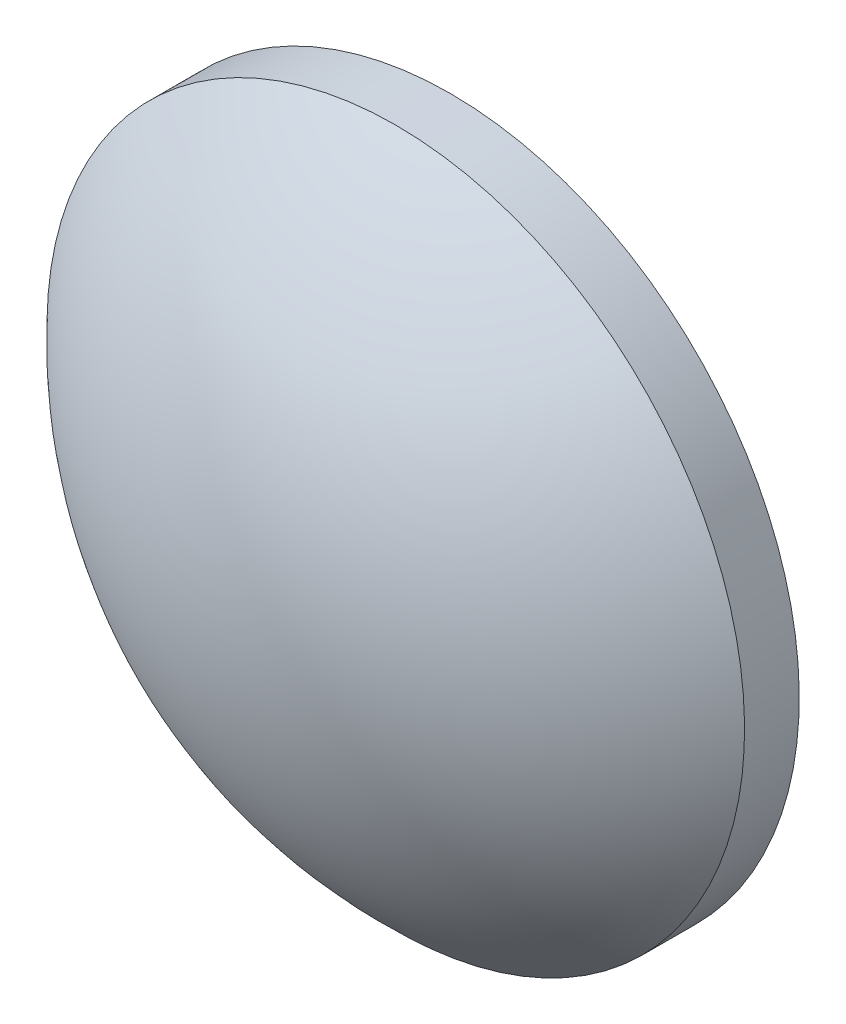
ISO-10303-21;
HEADER;
FILE_DESCRIPTION(('STEP AP214'),'2;1');
FILE_NAME('part.step','',(''),(''),'','','');
FILE_SCHEMA(('AUTOMOTIVE_DESIGN { 1 0 10303 214 1 1 1 1 }'));
ENDSEC;
DATA;
#1=APPLICATION_CONTEXT('core data for automotive mechanical design processes');
#2=APPLICATION_PROTOCOL_DEFINITION('international standard','automotive_design',2000,#1);
#3=PRODUCT_CONTEXT('',#1,'mechanical');
#4=PRODUCT('Part','Part','',(#3));
#5=PRODUCT_RELATED_PRODUCT_CATEGORY('part','',(#4));
#6=PRODUCT_DEFINITION_FORMATION('','',#4);
#7=PRODUCT_DEFINITION_CONTEXT('part definition',#1,'design');
#8=PRODUCT_DEFINITION('design','',#6,#7);
#9=PRODUCT_DEFINITION_SHAPE('','',#8);
#10=(LENGTH_UNIT() NAMED_UNIT(*) SI_UNIT(.MILLI.,.METRE.));
#11=(NAMED_UNIT(*) PLANE_ANGLE_UNIT() SI_UNIT($,.RADIAN.));
#12=(NAMED_UNIT(*) SI_UNIT($,.STERADIAN.) SOLID_ANGLE_UNIT());
#13=UNCERTAINTY_MEASURE_WITH_UNIT(LENGTH_MEASURE(1.E-05),#10,'distance_accuracy_value','');
#14=(GEOMETRIC_REPRESENTATION_CONTEXT(3) GLOBAL_UNCERTAINTY_ASSIGNED_CONTEXT((#13)) GLOBAL_UNIT_ASSIGNED_CONTEXT((#10,
#11,#12)) REPRESENTATION_CONTEXT('',''));
#15=CARTESIAN_POINT('',(0.,0.,0.));
#16=DIRECTION('',(0.,0.,1.));
#17=DIRECTION('',(1.,0.,0.));
#18=AXIS2_PLACEMENT_3D('',#15,#16,#17);
#19=CARTESIAN_POINT('',(0.,0.,-3.76));
#20=DIRECTION('',(0.,0.,-1.));
#21=DIRECTION('',(0.,1.,0.));
#22=AXIS2_PLACEMENT_3D('',#19,#20,#21);
#23=PLANE('',#22);
#24=CARTESIAN_POINT('',(0.,0.,-3.76));
#25=DIRECTION('',(0.,0.,-1.));
#26=DIRECTION('',(0.,1.,0.));
#27=AXIS2_PLACEMENT_3D('',#24,#25,#26);
#28=CIRCLE('',#27,12.7);
#29=CARTESIAN_POINT('',(0.,12.7,-3.76));
#30=VERTEX_POINT('',#29);
#31=EDGE_CURVE('E19',#30,#30,#28,.T.);
#32=ORIENTED_EDGE('',*,*,#31,.T.);
#33=EDGE_LOOP('',(#32));
#34=FACE_BOUND('',#33,.T.);
#35=ADVANCED_FACE('F13',(#34),#23,.T.);
#36=CARTESIAN_POINT('',(0.,0.,-13.5899999999998));
#37=DIRECTION('',(0.,0.,-1.));
#38=DIRECTION('',(0.,1.,0.));
#39=AXIS2_PLACEMENT_3D('',#36,#37,#38);
#40=SPHERICAL_SURFACE('',#39,17.3499999999999);
#41=CARTESIAN_POINT('',(0.,0.,-1.76914977677137));
#42=DIRECTION('',(0.,0.,-1.));
#43=DIRECTION('',(0.,1.,0.));
#44=AXIS2_PLACEMENT_3D('',#41,#42,#43);
#45=CIRCLE('',#44,12.6999999999999);
#46=CARTESIAN_POINT('',(0.,12.6999999999999,-1.76914977677137));
#47=VERTEX_POINT('',#46);
#48=EDGE_CURVE('E9',#47,#47,#45,.T.);
#49=ORIENTED_EDGE('',*,*,#48,.F.);
#50=EDGE_LOOP('',(#49));
#51=FACE_BOUND('',#50,.T.);
#52=ADVANCED_FACE('F28',(#51),#40,.T.);
#53=CARTESIAN_POINT('',(0.,0.,-3.76));
#54=DIRECTION('',(0.,0.,-1.));
#55=DIRECTION('',(0.,1.,0.));
#56=AXIS2_PLACEMENT_3D('',#53,#54,#55);
#57=CYLINDRICAL_SURFACE('',#56,12.7);
#58=ORIENTED_EDGE('',*,*,#48,.T.);
#59=EDGE_LOOP('',(#58));
#60=FACE_BOUND('',#59,.T.);
#61=ORIENTED_EDGE('',*,*,#31,.F.);
#62=EDGE_LOOP('',(#61));
#63=FACE_BOUND('',#62,.T.);
#64=ADVANCED_FACE('F26',(#60,#63),#57,.T.);
#65=CLOSED_SHELL('',(#35,#52,#64));
#66=MANIFOLD_SOLID_BREP('B1',#65);
#67=ADVANCED_BREP_SHAPE_REPRESENTATION('',(#18,#66),#14);
#68=SHAPE_DEFINITION_REPRESENTATION(#9,#67);
ENDSEC;
END-ISO-10303-21;
